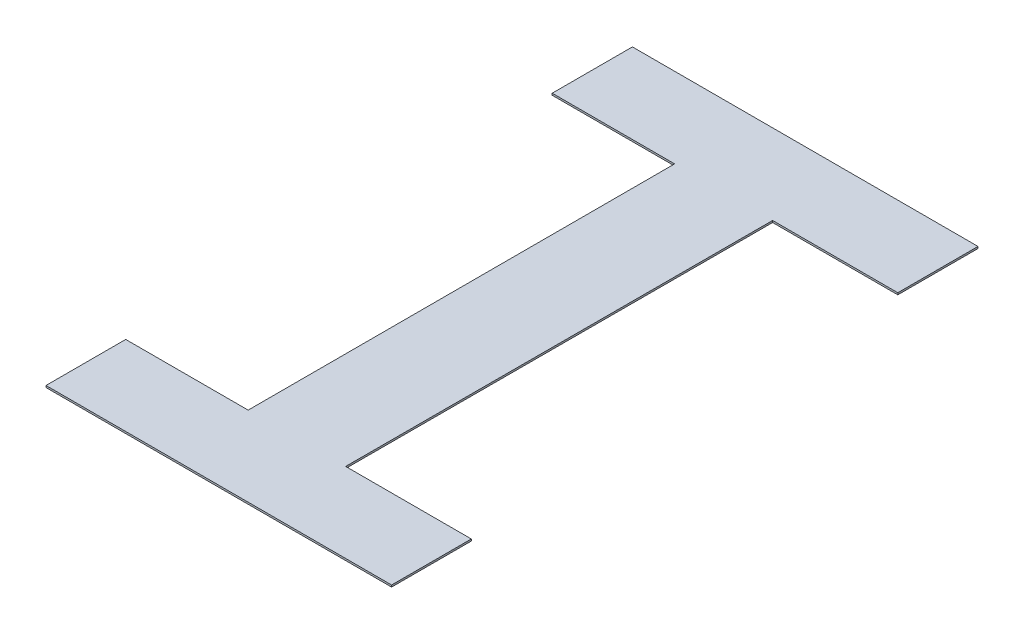
ISO-10303-21;
HEADER;
FILE_DESCRIPTION(('STEP AP214'),'2;1');
FILE_NAME('part.step','',(''),(''),'','','');
FILE_SCHEMA(('AUTOMOTIVE_DESIGN { 1 0 10303 214 1 1 1 1 }'));
ENDSEC;
DATA;
#1=APPLICATION_CONTEXT('core data for automotive mechanical design processes');
#2=APPLICATION_PROTOCOL_DEFINITION('international standard','automotive_design',2000,#1);
#3=PRODUCT_CONTEXT('',#1,'mechanical');
#4=PRODUCT('Part','Part','',(#3));
#5=PRODUCT_RELATED_PRODUCT_CATEGORY('part','',(#4));
#6=PRODUCT_DEFINITION_FORMATION('','',#4);
#7=PRODUCT_DEFINITION_CONTEXT('part definition',#1,'design');
#8=PRODUCT_DEFINITION('design','',#6,#7);
#9=PRODUCT_DEFINITION_SHAPE('','',#8);
#10=(LENGTH_UNIT() NAMED_UNIT(*) SI_UNIT(.MILLI.,.METRE.));
#11=(NAMED_UNIT(*) PLANE_ANGLE_UNIT() SI_UNIT($,.RADIAN.));
#12=(NAMED_UNIT(*) SI_UNIT($,.STERADIAN.) SOLID_ANGLE_UNIT());
#13=UNCERTAINTY_MEASURE_WITH_UNIT(LENGTH_MEASURE(1.E-05),#10,'distance_accuracy_value','');
#14=(GEOMETRIC_REPRESENTATION_CONTEXT(3) GLOBAL_UNCERTAINTY_ASSIGNED_CONTEXT((#13)) GLOBAL_UNIT_ASSIGNED_CONTEXT((#10,
#11,#12)) REPRESENTATION_CONTEXT('',''));
#15=CARTESIAN_POINT('',(0.,0.,0.));
#16=DIRECTION('',(0.,0.,1.));
#17=DIRECTION('',(1.,0.,0.));
#18=AXIS2_PLACEMENT_3D('',#15,#16,#17);
#19=CARTESIAN_POINT('',(0.,6.,0.));
#20=DIRECTION('',(0.,1.,0.));
#21=DIRECTION('',(1.,0.,0.));
#22=AXIS2_PLACEMENT_3D('',#19,#20,#21);
#23=PLANE('',#22);
#24=DIRECTION('',(-1.,0.,0.));
#25=VECTOR('',#24,1.);
#26=CARTESIAN_POINT('',(-12.25165807831,6.,0.859042110188));
#27=LINE('',#26,#25);
#28=CARTESIAN_POINT('',(-12.25165807831,6.,0.859042110188));
#29=VERTEX_POINT('',#28);
#30=CARTESIAN_POINT('',(-14.12280174946,6.,0.859042110188));
#31=VERTEX_POINT('',#30);
#32=EDGE_CURVE('E187',#29,#31,#27,.T.);
#33=ORIENTED_EDGE('',*,*,#32,.F.);
#34=DIRECTION('',(0.,0.,-1.));
#35=VECTOR('',#34,1.);
#36=CARTESIAN_POINT('',(-12.25165807831,6.,1.293230144376));
#37=LINE('',#36,#35);
#38=CARTESIAN_POINT('',(-12.25165807831,6.,1.293230144376));
#39=VERTEX_POINT('',#38);
#40=EDGE_CURVE('E27',#39,#29,#37,.T.);
#41=ORIENTED_EDGE('',*,*,#40,.F.);
#42=DIRECTION('',(1.,0.,0.));
#43=VECTOR('',#42,1.);
#44=CARTESIAN_POINT('',(-12.92943076859,6.,1.293230144376));
#45=LINE('',#44,#43);
#46=CARTESIAN_POINT('',(-12.92943076859,6.,1.293230144376));
#47=VERTEX_POINT('',#46);
#48=EDGE_CURVE('E181',#47,#39,#45,.T.);
#49=ORIENTED_EDGE('',*,*,#48,.F.);
#50=DIRECTION('',(0.00111919347924176,0.,-0.999999373702782));
#51=VECTOR('',#50,1.);
#52=CARTESIAN_POINT('',(-12.93201522117,6.,3.602438528585));
#53=LINE('',#52,#51);
#54=CARTESIAN_POINT('',(-12.93201522117,6.,3.602438528585));
#55=VERTEX_POINT('',#54);
#56=EDGE_CURVE('E198',#55,#47,#53,.T.);
#57=ORIENTED_EDGE('',*,*,#56,.F.);
#58=DIRECTION('',(-1.,0.,0.));
#59=VECTOR('',#58,1.);
#60=CARTESIAN_POINT('',(-12.25165807831,6.,3.602438528585));
#61=LINE('',#60,#59);
#62=CARTESIAN_POINT('',(-12.25165807831,6.,3.602438528585));
#63=VERTEX_POINT('',#62);
#64=EDGE_CURVE('E228',#63,#55,#61,.T.);
#65=ORIENTED_EDGE('',*,*,#64,.F.);
#66=DIRECTION('',(0.,0.,-1.));
#67=VECTOR('',#66,1.);
#68=CARTESIAN_POINT('',(-12.25165807831,6.,4.034042110188));
#69=LINE('',#68,#67);
#70=CARTESIAN_POINT('',(-12.25165807831,6.,4.034042110188));
#71=VERTEX_POINT('',#70);
#72=EDGE_CURVE('E20',#71,#63,#69,.T.);
#73=ORIENTED_EDGE('',*,*,#72,.F.);
#74=DIRECTION('',(1.,0.,0.));
#75=VECTOR('',#74,1.);
#76=CARTESIAN_POINT('',(-14.12280174946,6.,4.034042110188));
#77=LINE('',#76,#75);
#78=CARTESIAN_POINT('',(-14.12280174946,6.,4.034042110188));
#79=VERTEX_POINT('',#78);
#80=EDGE_CURVE('E177',#79,#71,#77,.T.);
#81=ORIENTED_EDGE('',*,*,#80,.F.);
#82=DIRECTION('',(0.,0.,1.));
#83=VECTOR('',#82,1.);
#84=CARTESIAN_POINT('',(-14.12280174946,6.,3.602438528585));
#85=LINE('',#84,#83);
#86=CARTESIAN_POINT('',(-14.12280174946,6.,3.602438528585));
#87=VERTEX_POINT('',#86);
#88=EDGE_CURVE('E90',#87,#79,#85,.T.);
#89=ORIENTED_EDGE('',*,*,#88,.F.);
#90=DIRECTION('',(-1.,0.,0.));
#91=VECTOR('',#90,1.);
#92=CARTESIAN_POINT('',(-13.45988966155,6.,3.602438528585));
#93=LINE('',#92,#91);
#94=CARTESIAN_POINT('',(-13.45988966155,6.,3.602438528585));
#95=VERTEX_POINT('',#94);
#96=EDGE_CURVE('E146',#95,#87,#93,.T.);
#97=ORIENTED_EDGE('',*,*,#96,.F.);
#98=DIRECTION('',(0.,0.,1.));
#99=VECTOR('',#98,1.);
#100=CARTESIAN_POINT('',(-13.45988966155,6.,1.293230144376));
#101=LINE('',#100,#99);
#102=CARTESIAN_POINT('',(-13.45988966155,6.,1.293230144376));
#103=VERTEX_POINT('',#102);
#104=EDGE_CURVE('E139',#103,#95,#101,.T.);
#105=ORIENTED_EDGE('',*,*,#104,.F.);
#106=DIRECTION('',(1.,0.,0.));
#107=VECTOR('',#106,1.);
#108=CARTESIAN_POINT('',(-14.12280174946,6.,1.293230144376));
#109=LINE('',#108,#107);
#110=CARTESIAN_POINT('',(-14.12280174946,6.,1.293230144376));
#111=VERTEX_POINT('',#110);
#112=EDGE_CURVE('E143',#111,#103,#109,.T.);
#113=ORIENTED_EDGE('',*,*,#112,.F.);
#114=DIRECTION('',(0.,0.,1.));
#115=VECTOR('',#114,1.);
#116=CARTESIAN_POINT('',(-14.12280174946,6.,0.859042110188));
#117=LINE('',#116,#115);
#118=EDGE_CURVE('E202',#31,#111,#117,.T.);
#119=ORIENTED_EDGE('',*,*,#118,.F.);
#120=EDGE_LOOP('',(#33,#41,#49,#57,#65,#73,#81,#89,#97,#105,#113,#119));
#121=FACE_BOUND('',#120,.T.);
#122=ADVANCED_FACE('F16',(#121),#23,.F.);
#123=CARTESIAN_POINT('',(0.,6.01,0.));
#124=DIRECTION('',(0.,1.,0.));
#125=DIRECTION('',(1.,0.,0.));
#126=AXIS2_PLACEMENT_3D('',#123,#124,#125);
#127=PLANE('',#126);
#128=DIRECTION('',(-1.,0.,0.));
#129=VECTOR('',#128,1.);
#130=CARTESIAN_POINT('',(-12.25165807831,6.01,0.859042110188));
#131=LINE('',#130,#129);
#132=CARTESIAN_POINT('',(-12.25165807831,6.01,0.859042110188));
#133=VERTEX_POINT('',#132);
#134=CARTESIAN_POINT('',(-14.12280174946,6.01,0.859042110188));
#135=VERTEX_POINT('',#134);
#136=EDGE_CURVE('E209',#133,#135,#131,.T.);
#137=ORIENTED_EDGE('',*,*,#136,.T.);
#138=DIRECTION('',(0.,0.,1.));
#139=VECTOR('',#138,1.);
#140=CARTESIAN_POINT('',(-14.12280174946,6.01,0.859042110188));
#141=LINE('',#140,#139);
#142=CARTESIAN_POINT('',(-14.12280174946,6.01,1.293230144376));
#143=VERTEX_POINT('',#142);
#144=EDGE_CURVE('E167',#135,#143,#141,.T.);
#145=ORIENTED_EDGE('',*,*,#144,.T.);
#146=DIRECTION('',(1.,0.,0.));
#147=VECTOR('',#146,1.);
#148=CARTESIAN_POINT('',(-14.12280174946,6.01,1.293230144376));
#149=LINE('',#148,#147);
#150=CARTESIAN_POINT('',(-13.45988966155,6.01,1.293230144376));
#151=VERTEX_POINT('',#150);
#152=EDGE_CURVE('E152',#143,#151,#149,.T.);
#153=ORIENTED_EDGE('',*,*,#152,.T.);
#154=DIRECTION('',(0.,0.,1.));
#155=VECTOR('',#154,1.);
#156=CARTESIAN_POINT('',(-13.45988966155,6.01,1.293230144376));
#157=LINE('',#156,#155);
#158=CARTESIAN_POINT('',(-13.45988966155,6.01,3.602438528585));
#159=VERTEX_POINT('',#158);
#160=EDGE_CURVE('E157',#151,#159,#157,.T.);
#161=ORIENTED_EDGE('',*,*,#160,.T.);
#162=DIRECTION('',(-1.,0.,0.));
#163=VECTOR('',#162,1.);
#164=CARTESIAN_POINT('',(-13.45988966155,6.01,3.602438528585));
#165=LINE('',#164,#163);
#166=CARTESIAN_POINT('',(-14.12280174946,6.01,3.602438528585));
#167=VERTEX_POINT('',#166);
#168=EDGE_CURVE('E205',#159,#167,#165,.T.);
#169=ORIENTED_EDGE('',*,*,#168,.T.);
#170=DIRECTION('',(0.,0.,1.));
#171=VECTOR('',#170,1.);
#172=CARTESIAN_POINT('',(-14.12280174946,6.01,3.602438528585));
#173=LINE('',#172,#171);
#174=CARTESIAN_POINT('',(-14.12280174946,6.01,4.034042110188));
#175=VERTEX_POINT('',#174);
#176=EDGE_CURVE('E78',#167,#175,#173,.T.);
#177=ORIENTED_EDGE('',*,*,#176,.T.);
#178=DIRECTION('',(1.,0.,0.));
#179=VECTOR('',#178,1.);
#180=CARTESIAN_POINT('',(-14.12280174946,6.01,4.034042110188));
#181=LINE('',#180,#179);
#182=CARTESIAN_POINT('',(-12.25165807831,6.01,4.034042110188));
#183=VERTEX_POINT('',#182);
#184=EDGE_CURVE('E220',#175,#183,#181,.T.);
#185=ORIENTED_EDGE('',*,*,#184,.T.);
#186=DIRECTION('',(0.,0.,-1.));
#187=VECTOR('',#186,1.);
#188=CARTESIAN_POINT('',(-12.25165807831,6.01,4.034042110188));
#189=LINE('',#188,#187);
#190=CARTESIAN_POINT('',(-12.25165807831,6.01,3.602438528585));
#191=VERTEX_POINT('',#190);
#192=EDGE_CURVE('E247',#183,#191,#189,.T.);
#193=ORIENTED_EDGE('',*,*,#192,.T.);
#194=DIRECTION('',(-1.,0.,0.));
#195=VECTOR('',#194,1.);
#196=CARTESIAN_POINT('',(-12.25165807831,6.01,3.602438528585));
#197=LINE('',#196,#195);
#198=CARTESIAN_POINT('',(-12.93201522117,6.01,3.602438528585));
#199=VERTEX_POINT('',#198);
#200=EDGE_CURVE('E210',#191,#199,#197,.T.);
#201=ORIENTED_EDGE('',*,*,#200,.T.);
#202=DIRECTION('',(0.00111919347924176,0.,-0.999999373702782));
#203=VECTOR('',#202,1.);
#204=CARTESIAN_POINT('',(-12.93201522117,6.01,3.602438528585));
#205=LINE('',#204,#203);
#206=CARTESIAN_POINT('',(-12.92943076859,6.01,1.293230144376));
#207=VERTEX_POINT('',#206);
#208=EDGE_CURVE('E186',#199,#207,#205,.T.);
#209=ORIENTED_EDGE('',*,*,#208,.T.);
#210=DIRECTION('',(1.,0.,0.));
#211=VECTOR('',#210,1.);
#212=CARTESIAN_POINT('',(-12.92943076859,6.01,1.293230144376));
#213=LINE('',#212,#211);
#214=CARTESIAN_POINT('',(-12.25165807831,6.01,1.293230144376));
#215=VERTEX_POINT('',#214);
#216=EDGE_CURVE('E238',#207,#215,#213,.T.);
#217=ORIENTED_EDGE('',*,*,#216,.T.);
#218=DIRECTION('',(0.,0.,-1.));
#219=VECTOR('',#218,1.);
#220=CARTESIAN_POINT('',(-12.25165807831,6.01,1.293230144376));
#221=LINE('',#220,#219);
#222=EDGE_CURVE('E11',#215,#133,#221,.T.);
#223=ORIENTED_EDGE('',*,*,#222,.T.);
#224=EDGE_LOOP('',(#137,#145,#153,#161,#169,#177,#185,#193,#201,#209,#217,#223));
#225=FACE_BOUND('',#224,.T.);
#226=ADVANCED_FACE('F281',(#225),#127,.T.);
#227=CARTESIAN_POINT('',(-12.25165807831,6.01,1.293230144376));
#228=DIRECTION('',(-1.,0.,0.));
#229=DIRECTION('',(0.,0.,1.));
#230=AXIS2_PLACEMENT_3D('',#227,#228,#229);
#231=PLANE('',#230);
#232=ORIENTED_EDGE('',*,*,#40,.T.);
#233=DIRECTION('',(0.,-1.,0.));
#234=VECTOR('',#233,1.);
#235=CARTESIAN_POINT('',(-12.25165807831,6.01,0.859042110188));
#236=LINE('',#235,#234);
#237=EDGE_CURVE('E217',#133,#29,#236,.T.);
#238=ORIENTED_EDGE('',*,*,#237,.F.);
#239=ORIENTED_EDGE('',*,*,#222,.F.);
#240=DIRECTION('',(0.,-1.,0.));
#241=VECTOR('',#240,1.);
#242=CARTESIAN_POINT('',(-12.25165807831,6.01,1.293230144376));
#243=LINE('',#242,#241);
#244=EDGE_CURVE('E185',#215,#39,#243,.T.);
#245=ORIENTED_EDGE('',*,*,#244,.T.);
#246=EDGE_LOOP('',(#232,#238,#239,#245));
#247=FACE_BOUND('',#246,.T.);
#248=ADVANCED_FACE('F18',(#247),#231,.F.);
#249=CARTESIAN_POINT('',(-12.92943076859,6.01,1.293230144376));
#250=DIRECTION('',(0.,0.,-1.));
#251=DIRECTION('',(0.,-1.,0.));
#252=AXIS2_PLACEMENT_3D('',#249,#250,#251);
#253=PLANE('',#252);
#254=ORIENTED_EDGE('',*,*,#48,.T.);
#255=ORIENTED_EDGE('',*,*,#244,.F.);
#256=ORIENTED_EDGE('',*,*,#216,.F.);
#257=DIRECTION('',(0.,-1.,0.));
#258=VECTOR('',#257,1.);
#259=CARTESIAN_POINT('',(-12.92943076859,6.01,1.293230144376));
#260=LINE('',#259,#258);
#261=EDGE_CURVE('E195',#207,#47,#260,.T.);
#262=ORIENTED_EDGE('',*,*,#261,.T.);
#263=EDGE_LOOP('',(#254,#255,#256,#262));
#264=FACE_BOUND('',#263,.T.);
#265=ADVANCED_FACE('F273',(#264),#253,.F.);
#266=CARTESIAN_POINT('',(-12.93201522117,6.01,3.602438528585));
#267=DIRECTION('',(-0.999999373702782,0.,-0.00111919347924176));
#268=DIRECTION('',(-0.00111919347924176,0.,0.999999373702782));
#269=AXIS2_PLACEMENT_3D('',#266,#267,#268);
#270=PLANE('',#269);
#271=ORIENTED_EDGE('',*,*,#56,.T.);
#272=ORIENTED_EDGE('',*,*,#261,.F.);
#273=ORIENTED_EDGE('',*,*,#208,.F.);
#274=DIRECTION('',(0.,-1.,0.));
#275=VECTOR('',#274,1.);
#276=CARTESIAN_POINT('',(-12.93201522117,6.01,3.602438528585));
#277=LINE('',#276,#275);
#278=EDGE_CURVE('E214',#199,#55,#277,.T.);
#279=ORIENTED_EDGE('',*,*,#278,.T.);
#280=EDGE_LOOP('',(#271,#272,#273,#279));
#281=FACE_BOUND('',#280,.T.);
#282=ADVANCED_FACE('F284',(#281),#270,.F.);
#283=CARTESIAN_POINT('',(-12.25165807831,6.01,3.602438528585));
#284=DIRECTION('',(0.,0.,1.));
#285=DIRECTION('',(1.,0.,0.));
#286=AXIS2_PLACEMENT_3D('',#283,#284,#285);
#287=PLANE('',#286);
#288=ORIENTED_EDGE('',*,*,#64,.T.);
#289=ORIENTED_EDGE('',*,*,#278,.F.);
#290=ORIENTED_EDGE('',*,*,#200,.F.);
#291=DIRECTION('',(0.,-1.,0.));
#292=VECTOR('',#291,1.);
#293=CARTESIAN_POINT('',(-12.25165807831,6.01,3.602438528585));
#294=LINE('',#293,#292);
#295=EDGE_CURVE('E251',#191,#63,#294,.T.);
#296=ORIENTED_EDGE('',*,*,#295,.T.);
#297=EDGE_LOOP('',(#288,#289,#290,#296));
#298=FACE_BOUND('',#297,.T.);
#299=ADVANCED_FACE('F324',(#298),#287,.F.);
#300=CARTESIAN_POINT('',(-12.25165807831,6.01,4.034042110188));
#301=DIRECTION('',(-1.,0.,0.));
#302=DIRECTION('',(0.,0.,1.));
#303=AXIS2_PLACEMENT_3D('',#300,#301,#302);
#304=PLANE('',#303);
#305=ORIENTED_EDGE('',*,*,#72,.T.);
#306=ORIENTED_EDGE('',*,*,#295,.F.);
#307=ORIENTED_EDGE('',*,*,#192,.F.);
#308=DIRECTION('',(0.,-1.,0.));
#309=VECTOR('',#308,1.);
#310=CARTESIAN_POINT('',(-12.25165807831,6.01,4.034042110188));
#311=LINE('',#310,#309);
#312=EDGE_CURVE('E224',#183,#71,#311,.T.);
#313=ORIENTED_EDGE('',*,*,#312,.T.);
#314=EDGE_LOOP('',(#305,#306,#307,#313));
#315=FACE_BOUND('',#314,.T.);
#316=ADVANCED_FACE('F298',(#315),#304,.F.);
#317=CARTESIAN_POINT('',(-14.12280174946,6.01,4.034042110188));
#318=DIRECTION('',(0.,0.,-1.));
#319=DIRECTION('',(0.,-1.,0.));
#320=AXIS2_PLACEMENT_3D('',#317,#318,#319);
#321=PLANE('',#320);
#322=ORIENTED_EDGE('',*,*,#80,.T.);
#323=ORIENTED_EDGE('',*,*,#312,.F.);
#324=ORIENTED_EDGE('',*,*,#184,.F.);
#325=DIRECTION('',(0.,-1.,0.));
#326=VECTOR('',#325,1.);
#327=CARTESIAN_POINT('',(-14.12280174946,6.01,4.034042110188));
#328=LINE('',#327,#326);
#329=EDGE_CURVE('E180',#175,#79,#328,.T.);
#330=ORIENTED_EDGE('',*,*,#329,.T.);
#331=EDGE_LOOP('',(#322,#323,#324,#330));
#332=FACE_BOUND('',#331,.T.);
#333=ADVANCED_FACE('F293',(#332),#321,.F.);
#334=CARTESIAN_POINT('',(-14.12280174946,6.01,3.602438528585));
#335=DIRECTION('',(1.,0.,0.));
#336=DIRECTION('',(0.,1.,0.));
#337=AXIS2_PLACEMENT_3D('',#334,#335,#336);
#338=PLANE('',#337);
#339=ORIENTED_EDGE('',*,*,#88,.T.);
#340=ORIENTED_EDGE('',*,*,#329,.F.);
#341=ORIENTED_EDGE('',*,*,#176,.F.);
#342=DIRECTION('',(0.,-1.,0.));
#343=VECTOR('',#342,1.);
#344=CARTESIAN_POINT('',(-14.12280174946,6.01,3.602438528585));
#345=LINE('',#344,#343);
#346=EDGE_CURVE('E194',#167,#87,#345,.T.);
#347=ORIENTED_EDGE('',*,*,#346,.T.);
#348=EDGE_LOOP('',(#339,#340,#341,#347));
#349=FACE_BOUND('',#348,.T.);
#350=ADVANCED_FACE('F300',(#349),#338,.F.);
#351=CARTESIAN_POINT('',(-13.45988966155,6.01,3.602438528585));
#352=DIRECTION('',(0.,0.,1.));
#353=DIRECTION('',(1.,0.,0.));
#354=AXIS2_PLACEMENT_3D('',#351,#352,#353);
#355=PLANE('',#354);
#356=ORIENTED_EDGE('',*,*,#96,.T.);
#357=ORIENTED_EDGE('',*,*,#346,.F.);
#358=ORIENTED_EDGE('',*,*,#168,.F.);
#359=DIRECTION('',(0.,-1.,0.));
#360=VECTOR('',#359,1.);
#361=CARTESIAN_POINT('',(-13.45988966155,6.01,3.602438528585));
#362=LINE('',#361,#360);
#363=EDGE_CURVE('E151',#159,#95,#362,.T.);
#364=ORIENTED_EDGE('',*,*,#363,.T.);
#365=EDGE_LOOP('',(#356,#357,#358,#364));
#366=FACE_BOUND('',#365,.T.);
#367=ADVANCED_FACE('F302',(#366),#355,.F.);
#368=CARTESIAN_POINT('',(-13.45988966155,6.01,1.293230144376));
#369=DIRECTION('',(1.,0.,0.));
#370=DIRECTION('',(0.,1.,0.));
#371=AXIS2_PLACEMENT_3D('',#368,#369,#370);
#372=PLANE('',#371);
#373=ORIENTED_EDGE('',*,*,#104,.T.);
#374=ORIENTED_EDGE('',*,*,#363,.F.);
#375=ORIENTED_EDGE('',*,*,#160,.F.);
#376=DIRECTION('',(0.,-1.,0.));
#377=VECTOR('',#376,1.);
#378=CARTESIAN_POINT('',(-13.45988966155,6.01,1.293230144376));
#379=LINE('',#378,#377);
#380=EDGE_CURVE('E154',#151,#103,#379,.T.);
#381=ORIENTED_EDGE('',*,*,#380,.T.);
#382=EDGE_LOOP('',(#373,#374,#375,#381));
#383=FACE_BOUND('',#382,.T.);
#384=ADVANCED_FACE('F155',(#383),#372,.F.);
#385=CARTESIAN_POINT('',(-14.12280174946,6.01,1.293230144376));
#386=DIRECTION('',(0.,0.,-1.));
#387=DIRECTION('',(0.,-1.,0.));
#388=AXIS2_PLACEMENT_3D('',#385,#386,#387);
#389=PLANE('',#388);
#390=ORIENTED_EDGE('',*,*,#112,.T.);
#391=ORIENTED_EDGE('',*,*,#380,.F.);
#392=ORIENTED_EDGE('',*,*,#152,.F.);
#393=DIRECTION('',(0.,-1.,0.));
#394=VECTOR('',#393,1.);
#395=CARTESIAN_POINT('',(-14.12280174946,6.01,1.293230144376));
#396=LINE('',#395,#394);
#397=EDGE_CURVE('E164',#143,#111,#396,.T.);
#398=ORIENTED_EDGE('',*,*,#397,.T.);
#399=EDGE_LOOP('',(#390,#391,#392,#398));
#400=FACE_BOUND('',#399,.T.);
#401=ADVANCED_FACE('F162',(#400),#389,.F.);
#402=CARTESIAN_POINT('',(-14.12280174946,6.01,0.859042110188));
#403=DIRECTION('',(1.,0.,0.));
#404=DIRECTION('',(0.,1.,0.));
#405=AXIS2_PLACEMENT_3D('',#402,#403,#404);
#406=PLANE('',#405);
#407=ORIENTED_EDGE('',*,*,#118,.T.);
#408=ORIENTED_EDGE('',*,*,#397,.F.);
#409=ORIENTED_EDGE('',*,*,#144,.F.);
#410=DIRECTION('',(0.,-1.,0.));
#411=VECTOR('',#410,1.);
#412=CARTESIAN_POINT('',(-14.12280174946,6.01,0.859042110188));
#413=LINE('',#412,#411);
#414=EDGE_CURVE('E191',#135,#31,#413,.T.);
#415=ORIENTED_EDGE('',*,*,#414,.T.);
#416=EDGE_LOOP('',(#407,#408,#409,#415));
#417=FACE_BOUND('',#416,.T.);
#418=ADVANCED_FACE('F330',(#417),#406,.F.);
#419=CARTESIAN_POINT('',(-12.25165807831,6.01,0.859042110188));
#420=DIRECTION('',(0.,0.,1.));
#421=DIRECTION('',(1.,0.,0.));
#422=AXIS2_PLACEMENT_3D('',#419,#420,#421);
#423=PLANE('',#422);
#424=ORIENTED_EDGE('',*,*,#32,.T.);
#425=ORIENTED_EDGE('',*,*,#414,.F.);
#426=ORIENTED_EDGE('',*,*,#136,.F.);
#427=ORIENTED_EDGE('',*,*,#237,.T.);
#428=EDGE_LOOP('',(#424,#425,#426,#427));
#429=FACE_BOUND('',#428,.T.);
#430=ADVANCED_FACE('F278',(#429),#423,.F.);
#431=CLOSED_SHELL('',(#122,#226,#248,#265,#282,#299,#316,#333,#350,#367,#384,#401,#418,#430));
#432=MANIFOLD_SOLID_BREP('B1',#431);
#433=ADVANCED_BREP_SHAPE_REPRESENTATION('',(#18,#432),#14);
#434=SHAPE_DEFINITION_REPRESENTATION(#9,#433);
ENDSEC;
END-ISO-10303-21;
